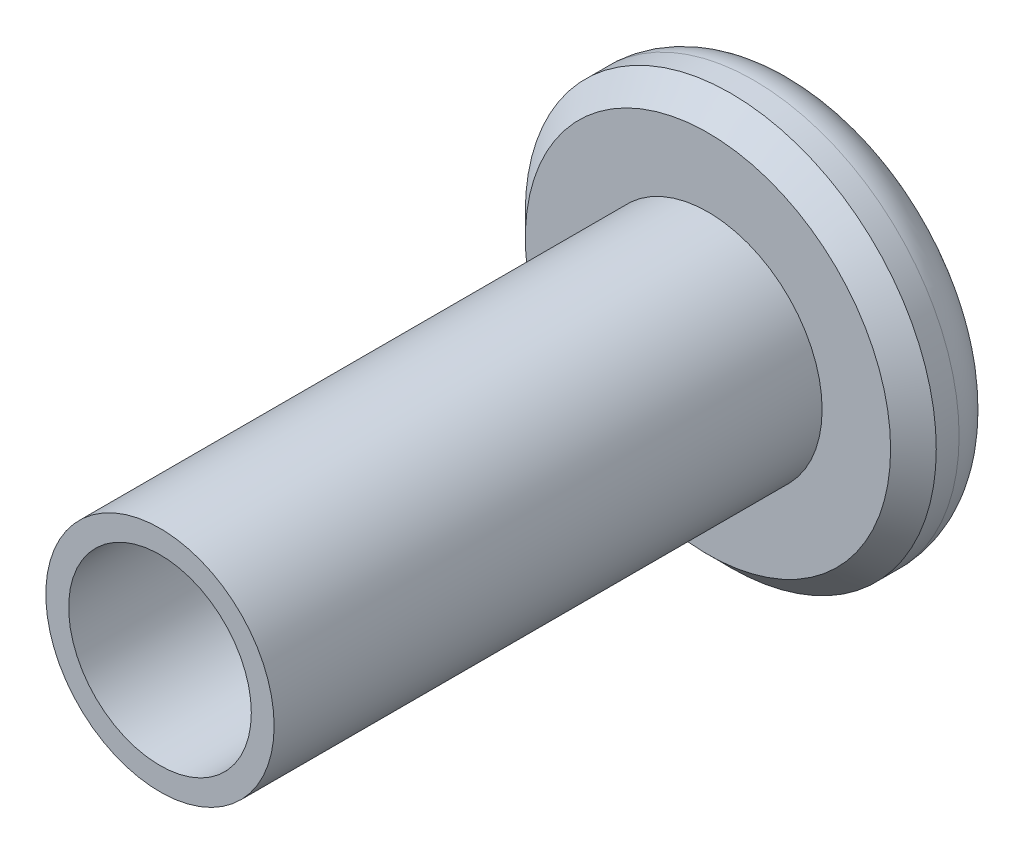
ISO-10303-21;
HEADER;
FILE_DESCRIPTION(('STEP AP214'),'2;1');
FILE_NAME('part.step','',(''),(''),'','','');
FILE_SCHEMA(('AUTOMOTIVE_DESIGN { 1 0 10303 214 1 1 1 1 }'));
ENDSEC;
DATA;
#1=APPLICATION_CONTEXT('core data for automotive mechanical design processes');
#2=APPLICATION_PROTOCOL_DEFINITION('international standard','automotive_design',2000,#1);
#3=PRODUCT_CONTEXT('',#1,'mechanical');
#4=PRODUCT('Part','Part','',(#3));
#5=PRODUCT_RELATED_PRODUCT_CATEGORY('part','',(#4));
#6=PRODUCT_DEFINITION_FORMATION('','',#4);
#7=PRODUCT_DEFINITION_CONTEXT('part definition',#1,'design');
#8=PRODUCT_DEFINITION('design','',#6,#7);
#9=PRODUCT_DEFINITION_SHAPE('','',#8);
#10=(LENGTH_UNIT() NAMED_UNIT(*) SI_UNIT(.MILLI.,.METRE.));
#11=(NAMED_UNIT(*) PLANE_ANGLE_UNIT() SI_UNIT($,.RADIAN.));
#12=(NAMED_UNIT(*) SI_UNIT($,.STERADIAN.) SOLID_ANGLE_UNIT());
#13=UNCERTAINTY_MEASURE_WITH_UNIT(LENGTH_MEASURE(1.E-05),#10,'distance_accuracy_value','');
#14=(GEOMETRIC_REPRESENTATION_CONTEXT(3) GLOBAL_UNCERTAINTY_ASSIGNED_CONTEXT((#13)) GLOBAL_UNIT_ASSIGNED_CONTEXT((#10,
#11,#12)) REPRESENTATION_CONTEXT('',''));
#15=CARTESIAN_POINT('',(0.,0.,0.));
#16=DIRECTION('',(0.,0.,1.));
#17=DIRECTION('',(1.,0.,0.));
#18=AXIS2_PLACEMENT_3D('',#15,#16,#17);
#19=CARTESIAN_POINT('',(0.,0.,2.));
#20=DIRECTION('',(0.,0.,-1.));
#21=DIRECTION('',(-1.,0.,0.));
#22=AXIS2_PLACEMENT_3D('',#19,#20,#21);
#23=CYLINDRICAL_SURFACE('',#22,4.5);
#24=CARTESIAN_POINT('',(0.,0.,1.5));
#25=DIRECTION('',(0.,0.,1.));
#26=DIRECTION('',(1.,0.,0.));
#27=AXIS2_PLACEMENT_3D('',#24,#25,#26);
#28=CIRCLE('',#27,4.5);
#29=CARTESIAN_POINT('',(4.5,0.,1.5));
#30=VERTEX_POINT('',#29);
#31=EDGE_CURVE('E11',#30,#30,#28,.F.);
#32=ORIENTED_EDGE('',*,*,#31,.T.);
#33=EDGE_LOOP('',(#32));
#34=FACE_BOUND('',#33,.T.);
#35=CARTESIAN_POINT('',(0.,0.,1.));
#36=DIRECTION('',(0.,0.,1.));
#37=DIRECTION('',(1.,0.,0.));
#38=AXIS2_PLACEMENT_3D('',#35,#36,#37);
#39=CIRCLE('',#38,4.5);
#40=CARTESIAN_POINT('',(4.5,0.,1.));
#41=VERTEX_POINT('',#40);
#42=EDGE_CURVE('E157',#41,#41,#39,.T.);
#43=ORIENTED_EDGE('',*,*,#42,.T.);
#44=EDGE_LOOP('',(#43));
#45=FACE_BOUND('',#44,.T.);
#46=ADVANCED_FACE('F37',(#34,#45),#23,.T.);
#47=CARTESIAN_POINT('',(0.,0.,2.));
#48=DIRECTION('',(0.,0.,1.));
#49=DIRECTION('',(1.,0.,0.));
#50=AXIS2_PLACEMENT_3D('',#47,#48,#49);
#51=PLANE('',#50);
#52=CARTESIAN_POINT('',(0.,0.,2.));
#53=DIRECTION('',(0.,0.,1.));
#54=DIRECTION('',(1.,0.,0.));
#55=AXIS2_PLACEMENT_3D('',#52,#53,#54);
#56=CIRCLE('',#55,3.99999999999999);
#57=CARTESIAN_POINT('',(3.99999999999999,0.,2.));
#58=VERTEX_POINT('',#57);
#59=EDGE_CURVE('E46',#58,#58,#56,.T.);
#60=ORIENTED_EDGE('',*,*,#59,.T.);
#61=EDGE_LOOP('',(#60));
#62=FACE_BOUND('',#61,.T.);
#63=CARTESIAN_POINT('',(0.,0.,2.));
#64=DIRECTION('',(0.,0.,1.));
#65=DIRECTION('',(1.,0.,0.));
#66=AXIS2_PLACEMENT_3D('',#63,#64,#65);
#67=CIRCLE('',#66,2.5);
#68=CARTESIAN_POINT('',(2.5,0.,2.));
#69=VERTEX_POINT('',#68);
#70=EDGE_CURVE('E148',#69,#69,#67,.T.);
#71=ORIENTED_EDGE('',*,*,#70,.F.);
#72=EDGE_LOOP('',(#71));
#73=FACE_BOUND('',#72,.T.);
#74=ADVANCED_FACE('F165',(#62,#73),#51,.T.);
#75=CARTESIAN_POINT('',(0.,0.,0.));
#76=DIRECTION('',(0.,0.,1.));
#77=DIRECTION('',(1.,0.,0.));
#78=AXIS2_PLACEMENT_3D('',#75,#76,#77);
#79=PLANE('',#78);
#80=DIRECTION('',(-0.5,0.866025403784439,0.));
#81=VECTOR('',#80,1.);
#82=CARTESIAN_POINT('',(-0.866025403784439,-1.5,0.));
#83=LINE('',#82,#81);
#84=CARTESIAN_POINT('',(-0.866025403784439,-1.5,0.));
#85=VERTEX_POINT('',#84);
#86=CARTESIAN_POINT('',(-1.73205080756888,0.,0.));
#87=VERTEX_POINT('',#86);
#88=EDGE_CURVE('E127',#85,#87,#83,.T.);
#89=ORIENTED_EDGE('',*,*,#88,.F.);
#90=DIRECTION('',(-1.,0.,0.));
#91=VECTOR('',#90,1.);
#92=CARTESIAN_POINT('',(0.866025403784439,-1.5,0.));
#93=LINE('',#92,#91);
#94=CARTESIAN_POINT('',(0.866025403784439,-1.5,0.));
#95=VERTEX_POINT('',#94);
#96=EDGE_CURVE('E53',#95,#85,#93,.T.);
#97=ORIENTED_EDGE('',*,*,#96,.F.);
#98=DIRECTION('',(-0.5,-0.866025403784439,0.));
#99=VECTOR('',#98,1.);
#100=CARTESIAN_POINT('',(1.73205080756888,0.,0.));
#101=LINE('',#100,#99);
#102=CARTESIAN_POINT('',(1.73205080756888,0.,0.));
#103=VERTEX_POINT('',#102);
#104=EDGE_CURVE('E136',#103,#95,#101,.T.);
#105=ORIENTED_EDGE('',*,*,#104,.F.);
#106=DIRECTION('',(0.5,-0.866025403784439,0.));
#107=VECTOR('',#106,1.);
#108=CARTESIAN_POINT('',(0.866025403784438,1.5,0.));
#109=LINE('',#108,#107);
#110=CARTESIAN_POINT('',(0.866025403784438,1.5,0.));
#111=VERTEX_POINT('',#110);
#112=EDGE_CURVE('E134',#111,#103,#109,.T.);
#113=ORIENTED_EDGE('',*,*,#112,.F.);
#114=DIRECTION('',(1.,0.,0.));
#115=VECTOR('',#114,1.);
#116=CARTESIAN_POINT('',(-0.866025403784439,1.5,0.));
#117=LINE('',#116,#115);
#118=CARTESIAN_POINT('',(-0.866025403784439,1.5,0.));
#119=VERTEX_POINT('',#118);
#120=EDGE_CURVE('E101',#119,#111,#117,.T.);
#121=ORIENTED_EDGE('',*,*,#120,.F.);
#122=DIRECTION('',(0.5,0.866025403784439,0.));
#123=VECTOR('',#122,1.);
#124=CARTESIAN_POINT('',(-1.73205080756888,0.,0.));
#125=LINE('',#124,#123);
#126=EDGE_CURVE('E130',#87,#119,#125,.T.);
#127=ORIENTED_EDGE('',*,*,#126,.F.);
#128=EDGE_LOOP('',(#89,#97,#105,#113,#121,#127));
#129=FACE_BOUND('',#128,.T.);
#130=CARTESIAN_POINT('',(0.,0.,0.));
#131=DIRECTION('',(0.,0.,1.));
#132=DIRECTION('',(1.,0.,0.));
#133=AXIS2_PLACEMENT_3D('',#130,#131,#132);
#134=CIRCLE('',#133,3.5);
#135=CARTESIAN_POINT('',(3.5,0.,0.));
#136=VERTEX_POINT('',#135);
#137=EDGE_CURVE('E160',#136,#136,#134,.F.);
#138=ORIENTED_EDGE('',*,*,#137,.T.);
#139=EDGE_LOOP('',(#138));
#140=FACE_BOUND('',#139,.T.);
#141=ADVANCED_FACE('F187',(#129,#140),#79,.F.);
#142=CARTESIAN_POINT('',(0.,0.,14.));
#143=DIRECTION('',(0.,0.,1.));
#144=DIRECTION('',(1.,0.,0.));
#145=AXIS2_PLACEMENT_3D('',#142,#143,#144);
#146=PLANE('',#145);
#147=CARTESIAN_POINT('',(0.,0.,14.));
#148=DIRECTION('',(0.,0.,1.));
#149=DIRECTION('',(1.,0.,0.));
#150=AXIS2_PLACEMENT_3D('',#147,#148,#149);
#151=CIRCLE('',#150,2.5);
#152=CARTESIAN_POINT('',(2.5,0.,14.));
#153=VERTEX_POINT('',#152);
#154=EDGE_CURVE('E149',#153,#153,#151,.T.);
#155=ORIENTED_EDGE('',*,*,#154,.T.);
#156=EDGE_LOOP('',(#155));
#157=FACE_BOUND('',#156,.T.);
#158=CARTESIAN_POINT('',(0.,0.,14.));
#159=DIRECTION('',(0.,0.,1.));
#160=DIRECTION('',(1.,0.,0.));
#161=AXIS2_PLACEMENT_3D('',#158,#159,#160);
#162=CIRCLE('',#161,2.);
#163=CARTESIAN_POINT('',(2.,0.,14.));
#164=VERTEX_POINT('',#163);
#165=EDGE_CURVE('E140',#164,#164,#162,.T.);
#166=ORIENTED_EDGE('',*,*,#165,.F.);
#167=EDGE_LOOP('',(#166));
#168=FACE_BOUND('',#167,.T.);
#169=ADVANCED_FACE('F192',(#157,#168),#146,.T.);
#170=CARTESIAN_POINT('',(0.,0.,14.));
#171=DIRECTION('',(0.,0.,-1.));
#172=DIRECTION('',(-1.,0.,0.));
#173=AXIS2_PLACEMENT_3D('',#170,#171,#172);
#174=CYLINDRICAL_SURFACE('',#173,2.5);
#175=ORIENTED_EDGE('',*,*,#154,.F.);
#176=EDGE_LOOP('',(#175));
#177=FACE_BOUND('',#176,.T.);
#178=ORIENTED_EDGE('',*,*,#70,.T.);
#179=EDGE_LOOP('',(#178));
#180=FACE_BOUND('',#179,.T.);
#181=ADVANCED_FACE('F195',(#177,#180),#174,.T.);
#182=CARTESIAN_POINT('',(0.,0.,14.));
#183=DIRECTION('',(0.,0.,-1.));
#184=DIRECTION('',(-1.,0.,0.));
#185=AXIS2_PLACEMENT_3D('',#182,#183,#184);
#186=CYLINDRICAL_SURFACE('',#185,2.);
#187=ORIENTED_EDGE('',*,*,#165,.T.);
#188=EDGE_LOOP('',(#187));
#189=FACE_BOUND('',#188,.T.);
#190=CARTESIAN_POINT('',(0.,0.,2.));
#191=DIRECTION('',(0.,0.,1.));
#192=DIRECTION('',(1.,0.,0.));
#193=AXIS2_PLACEMENT_3D('',#190,#191,#192);
#194=CIRCLE('',#193,2.);
#195=CARTESIAN_POINT('',(2.,0.,2.));
#196=VERTEX_POINT('',#195);
#197=EDGE_CURVE('E152',#196,#196,#194,.F.);
#198=ORIENTED_EDGE('',*,*,#197,.T.);
#199=EDGE_LOOP('',(#198));
#200=FACE_BOUND('',#199,.T.);
#201=ADVANCED_FACE('F198',(#189,#200),#186,.F.);
#202=ORIENTED_EDGE('',*,*,#197,.F.);
#203=EDGE_LOOP('',(#202));
#204=FACE_BOUND('',#203,.T.);
#205=ADVANCED_FACE('F178',(#204),#51,.T.);
#206=CARTESIAN_POINT('',(0.,0.,1.));
#207=DIRECTION('',(0.,0.,1.));
#208=DIRECTION('',(1.,0.,0.));
#209=AXIS2_PLACEMENT_3D('',#206,#207,#208);
#210=TOROIDAL_SURFACE('',#209,3.5,1.);
#211=ORIENTED_EDGE('',*,*,#137,.F.);
#212=EDGE_LOOP('',(#211));
#213=FACE_BOUND('',#212,.T.);
#214=ORIENTED_EDGE('',*,*,#42,.F.);
#215=EDGE_LOOP('',(#214));
#216=FACE_BOUND('',#215,.T.);
#217=ADVANCED_FACE('F170',(#213,#216),#210,.T.);
#218=CARTESIAN_POINT('',(0.,0.,2.));
#219=DIRECTION('',(0.,0.,-1.));
#220=DIRECTION('',(-1.,0.,0.));
#221=AXIS2_PLACEMENT_3D('',#218,#219,#220);
#222=CONICAL_SURFACE('',#221,3.99999999999999,0.785398163397448);
#223=ORIENTED_EDGE('',*,*,#31,.F.);
#224=EDGE_LOOP('',(#223));
#225=FACE_BOUND('',#224,.T.);
#226=ORIENTED_EDGE('',*,*,#59,.F.);
#227=EDGE_LOOP('',(#226));
#228=FACE_BOUND('',#227,.T.);
#229=ADVANCED_FACE('F40',(#225,#228),#222,.T.);
#230=CARTESIAN_POINT('',(0.866025403784439,-1.5,1.));
#231=DIRECTION('',(0.,-1.,0.));
#232=DIRECTION('',(1.,0.,0.));
#233=AXIS2_PLACEMENT_3D('',#230,#231,#232);
#234=PLANE('',#233);
#235=ORIENTED_EDGE('',*,*,#96,.T.);
#236=DIRECTION('',(0.,0.,-1.));
#237=VECTOR('',#236,1.);
#238=CARTESIAN_POINT('',(-0.866025403784439,-1.5,1.));
#239=LINE('',#238,#237);
#240=CARTESIAN_POINT('',(-0.866025403784439,-1.5,1.));
#241=VERTEX_POINT('',#240);
#242=EDGE_CURVE('E83',#241,#85,#239,.T.);
#243=ORIENTED_EDGE('',*,*,#242,.F.);
#244=DIRECTION('',(-1.,0.,0.));
#245=VECTOR('',#244,1.);
#246=CARTESIAN_POINT('',(0.866025403784439,-1.5,1.));
#247=LINE('',#246,#245);
#248=CARTESIAN_POINT('',(0.866025403784439,-1.5,1.));
#249=VERTEX_POINT('',#248);
#250=EDGE_CURVE('E138',#249,#241,#247,.T.);
#251=ORIENTED_EDGE('',*,*,#250,.F.);
#252=DIRECTION('',(0.,0.,-1.));
#253=VECTOR('',#252,1.);
#254=CARTESIAN_POINT('',(0.866025403784439,-1.5,1.));
#255=LINE('',#254,#253);
#256=EDGE_CURVE('E61',#249,#95,#255,.T.);
#257=ORIENTED_EDGE('',*,*,#256,.T.);
#258=EDGE_LOOP('',(#235,#243,#251,#257));
#259=FACE_BOUND('',#258,.T.);
#260=ADVANCED_FACE('F169',(#259),#234,.F.);
#261=CARTESIAN_POINT('',(1.73205080756888,0.,1.));
#262=DIRECTION('',(0.866025403784439,-0.5,0.));
#263=DIRECTION('',(0.5,0.866025403784439,0.));
#264=AXIS2_PLACEMENT_3D('',#261,#262,#263);
#265=PLANE('',#264);
#266=ORIENTED_EDGE('',*,*,#104,.T.);
#267=ORIENTED_EDGE('',*,*,#256,.F.);
#268=DIRECTION('',(-0.5,-0.866025403784439,0.));
#269=VECTOR('',#268,1.);
#270=CARTESIAN_POINT('',(1.73205080756888,0.,1.));
#271=LINE('',#270,#269);
#272=CARTESIAN_POINT('',(1.73205080756888,0.,1.));
#273=VERTEX_POINT('',#272);
#274=EDGE_CURVE('E113',#273,#249,#271,.T.);
#275=ORIENTED_EDGE('',*,*,#274,.F.);
#276=DIRECTION('',(0.,0.,-1.));
#277=VECTOR('',#276,1.);
#278=CARTESIAN_POINT('',(1.73205080756888,0.,1.));
#279=LINE('',#278,#277);
#280=EDGE_CURVE('E105',#273,#103,#279,.T.);
#281=ORIENTED_EDGE('',*,*,#280,.T.);
#282=EDGE_LOOP('',(#266,#267,#275,#281));
#283=FACE_BOUND('',#282,.T.);
#284=ADVANCED_FACE('F176',(#283),#265,.F.);
#285=CARTESIAN_POINT('',(0.866025403784438,1.5,1.));
#286=DIRECTION('',(0.866025403784439,0.5,0.));
#287=DIRECTION('',(-0.5,0.866025403784439,0.));
#288=AXIS2_PLACEMENT_3D('',#285,#286,#287);
#289=PLANE('',#288);
#290=ORIENTED_EDGE('',*,*,#112,.T.);
#291=ORIENTED_EDGE('',*,*,#280,.F.);
#292=DIRECTION('',(0.5,-0.866025403784439,0.));
#293=VECTOR('',#292,1.);
#294=CARTESIAN_POINT('',(0.866025403784438,1.5,1.));
#295=LINE('',#294,#293);
#296=CARTESIAN_POINT('',(0.866025403784438,1.5,1.));
#297=VERTEX_POINT('',#296);
#298=EDGE_CURVE('E109',#297,#273,#295,.T.);
#299=ORIENTED_EDGE('',*,*,#298,.F.);
#300=DIRECTION('',(0.,0.,-1.));
#301=VECTOR('',#300,1.);
#302=CARTESIAN_POINT('',(0.866025403784438,1.5,1.));
#303=LINE('',#302,#301);
#304=EDGE_CURVE('E94',#297,#111,#303,.T.);
#305=ORIENTED_EDGE('',*,*,#304,.T.);
#306=EDGE_LOOP('',(#290,#291,#299,#305));
#307=FACE_BOUND('',#306,.T.);
#308=ADVANCED_FACE('F110',(#307),#289,.F.);
#309=CARTESIAN_POINT('',(-0.866025403784439,1.5,1.));
#310=DIRECTION('',(0.,1.,0.));
#311=DIRECTION('',(0.,0.,1.));
#312=AXIS2_PLACEMENT_3D('',#309,#310,#311);
#313=PLANE('',#312);
#314=ORIENTED_EDGE('',*,*,#120,.T.);
#315=ORIENTED_EDGE('',*,*,#304,.F.);
#316=DIRECTION('',(1.,0.,0.));
#317=VECTOR('',#316,1.);
#318=CARTESIAN_POINT('',(-0.866025403784439,1.5,1.));
#319=LINE('',#318,#317);
#320=CARTESIAN_POINT('',(-0.866025403784439,1.5,1.));
#321=VERTEX_POINT('',#320);
#322=EDGE_CURVE('E98',#321,#297,#319,.T.);
#323=ORIENTED_EDGE('',*,*,#322,.F.);
#324=DIRECTION('',(0.,0.,-1.));
#325=VECTOR('',#324,1.);
#326=CARTESIAN_POINT('',(-0.866025403784439,1.5,1.));
#327=LINE('',#326,#325);
#328=EDGE_CURVE('E106',#321,#119,#327,.T.);
#329=ORIENTED_EDGE('',*,*,#328,.T.);
#330=EDGE_LOOP('',(#314,#315,#323,#329));
#331=FACE_BOUND('',#330,.T.);
#332=ADVANCED_FACE('F96',(#331),#313,.F.);
#333=CARTESIAN_POINT('',(-1.73205080756888,0.,1.));
#334=DIRECTION('',(-0.866025403784439,0.5,0.));
#335=DIRECTION('',(-0.5,-0.866025403784439,0.));
#336=AXIS2_PLACEMENT_3D('',#333,#334,#335);
#337=PLANE('',#336);
#338=ORIENTED_EDGE('',*,*,#126,.T.);
#339=ORIENTED_EDGE('',*,*,#328,.F.);
#340=DIRECTION('',(0.5,0.866025403784439,0.));
#341=VECTOR('',#340,1.);
#342=CARTESIAN_POINT('',(-1.73205080756888,0.,1.));
#343=LINE('',#342,#341);
#344=CARTESIAN_POINT('',(-1.73205080756888,0.,1.));
#345=VERTEX_POINT('',#344);
#346=EDGE_CURVE('E119',#345,#321,#343,.T.);
#347=ORIENTED_EDGE('',*,*,#346,.F.);
#348=DIRECTION('',(0.,0.,-1.));
#349=VECTOR('',#348,1.);
#350=CARTESIAN_POINT('',(-1.73205080756888,0.,1.));
#351=LINE('',#350,#349);
#352=EDGE_CURVE('E143',#345,#87,#351,.T.);
#353=ORIENTED_EDGE('',*,*,#352,.T.);
#354=EDGE_LOOP('',(#338,#339,#347,#353));
#355=FACE_BOUND('',#354,.T.);
#356=ADVANCED_FACE('F209',(#355),#337,.F.);
#357=CARTESIAN_POINT('',(-0.866025403784439,-1.5,1.));
#358=DIRECTION('',(-0.866025403784439,-0.5,0.));
#359=DIRECTION('',(0.5,-0.866025403784439,0.));
#360=AXIS2_PLACEMENT_3D('',#357,#358,#359);
#361=PLANE('',#360);
#362=ORIENTED_EDGE('',*,*,#88,.T.);
#363=ORIENTED_EDGE('',*,*,#352,.F.);
#364=DIRECTION('',(-0.5,0.866025403784439,0.));
#365=VECTOR('',#364,1.);
#366=CARTESIAN_POINT('',(-0.866025403784439,-1.5,1.));
#367=LINE('',#366,#365);
#368=EDGE_CURVE('E121',#241,#345,#367,.T.);
#369=ORIENTED_EDGE('',*,*,#368,.F.);
#370=ORIENTED_EDGE('',*,*,#242,.T.);
#371=EDGE_LOOP('',(#362,#363,#369,#370));
#372=FACE_BOUND('',#371,.T.);
#373=ADVANCED_FACE('F206',(#372),#361,.F.);
#374=CARTESIAN_POINT('',(0.,0.,1.));
#375=DIRECTION('',(0.,0.,-1.));
#376=DIRECTION('',(-1.,0.,0.));
#377=AXIS2_PLACEMENT_3D('',#374,#375,#376);
#378=PLANE('',#377);
#379=ORIENTED_EDGE('',*,*,#250,.T.);
#380=ORIENTED_EDGE('',*,*,#368,.T.);
#381=ORIENTED_EDGE('',*,*,#346,.T.);
#382=ORIENTED_EDGE('',*,*,#322,.T.);
#383=ORIENTED_EDGE('',*,*,#298,.T.);
#384=ORIENTED_EDGE('',*,*,#274,.T.);
#385=EDGE_LOOP('',(#379,#380,#381,#382,#383,#384));
#386=FACE_BOUND('',#385,.T.);
#387=ADVANCED_FACE('F116',(#386),#378,.T.);
#388=CLOSED_SHELL('',(#46,#74,#141,#169,#181,#201,#205,#217,#229,#260,#284,#308,#332,#356,#373,#387));
#389=MANIFOLD_SOLID_BREP('B2',#388);
#390=ADVANCED_BREP_SHAPE_REPRESENTATION('',(#18,#389),#14);
#391=SHAPE_DEFINITION_REPRESENTATION(#9,#390);
ENDSEC;
END-ISO-10303-21;
